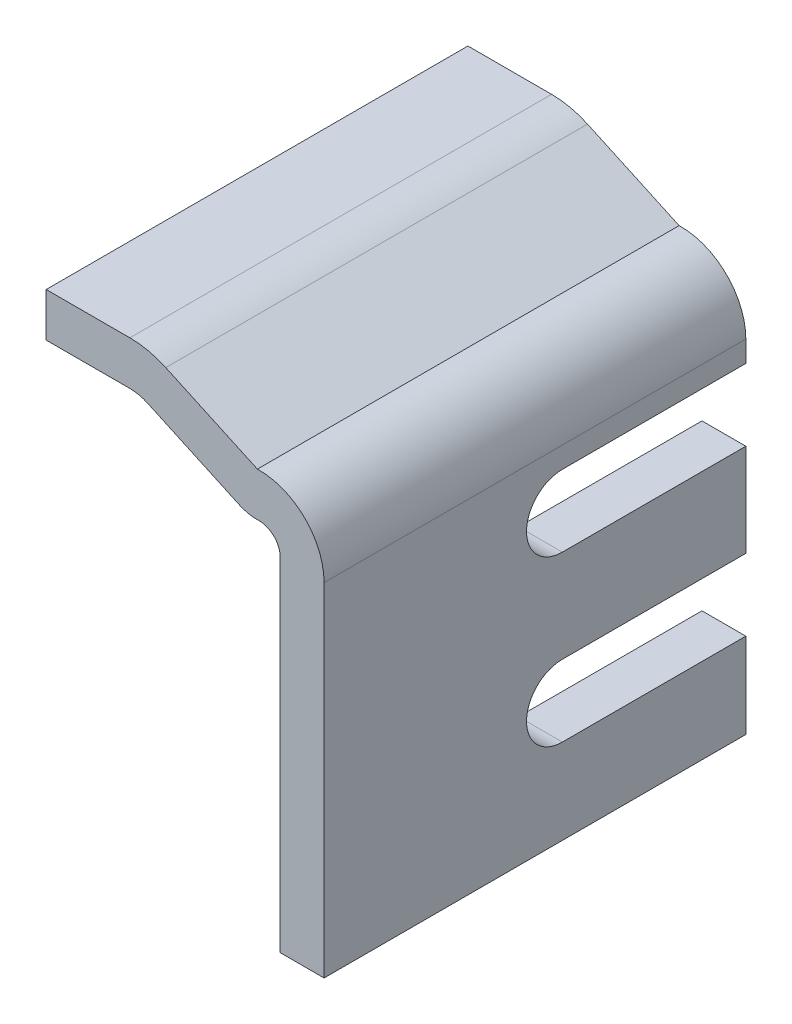
ISO-10303-21;
HEADER;
FILE_DESCRIPTION(('STEP AP214'),'2;1');
FILE_NAME('part.step','',(''),(''),'','','');
FILE_SCHEMA(('AUTOMOTIVE_DESIGN { 1 0 10303 214 1 1 1 1 }'));
ENDSEC;
DATA;
#1=APPLICATION_CONTEXT('core data for automotive mechanical design processes');
#2=APPLICATION_PROTOCOL_DEFINITION('international standard','automotive_design',2000,#1);
#3=PRODUCT_CONTEXT('',#1,'mechanical');
#4=PRODUCT('Part','Part','',(#3));
#5=PRODUCT_RELATED_PRODUCT_CATEGORY('part','',(#4));
#6=PRODUCT_DEFINITION_FORMATION('','',#4);
#7=PRODUCT_DEFINITION_CONTEXT('part definition',#1,'design');
#8=PRODUCT_DEFINITION('design','',#6,#7);
#9=PRODUCT_DEFINITION_SHAPE('','',#8);
#10=(LENGTH_UNIT() NAMED_UNIT(*) SI_UNIT(.MILLI.,.METRE.));
#11=(NAMED_UNIT(*) PLANE_ANGLE_UNIT() SI_UNIT($,.RADIAN.));
#12=(NAMED_UNIT(*) SI_UNIT($,.STERADIAN.) SOLID_ANGLE_UNIT());
#13=UNCERTAINTY_MEASURE_WITH_UNIT(LENGTH_MEASURE(1.E-05),#10,'distance_accuracy_value','');
#14=(GEOMETRIC_REPRESENTATION_CONTEXT(3) GLOBAL_UNCERTAINTY_ASSIGNED_CONTEXT((#13)) GLOBAL_UNIT_ASSIGNED_CONTEXT((#10,
#11,#12)) REPRESENTATION_CONTEXT('',''));
#15=CARTESIAN_POINT('',(0.,0.,0.));
#16=DIRECTION('',(0.,0.,1.));
#17=DIRECTION('',(1.,0.,0.));
#18=AXIS2_PLACEMENT_3D('',#15,#16,#17);
#19=CARTESIAN_POINT('',(-1.02145174439168,0.995862311877173,1.25));
#20=DIRECTION('',(0.,0.,1.));
#21=DIRECTION('',(1.,0.,0.));
#22=AXIS2_PLACEMENT_3D('',#19,#20,#21);
#23=CYLINDRICAL_SURFACE('',#22,0.25);
#24=DIRECTION('',(0.,0.,1.));
#25=VECTOR('',#24,1.);
#26=CARTESIAN_POINT('',(-0.917103913698396,1.22304402379432,1.25));
#27=LINE('',#26,#25);
#28=CARTESIAN_POINT('',(-0.917103913698397,1.22304402379432,-1.25));
#29=VERTEX_POINT('',#28);
#30=CARTESIAN_POINT('',(-0.917103913698397,1.22304402379432,1.25));
#31=VERTEX_POINT('',#30);
#32=EDGE_CURVE('E160',#29,#31,#27,.T.);
#33=ORIENTED_EDGE('',*,*,#32,.T.);
#34=CARTESIAN_POINT('',(-1.02145174439168,0.995862311877173,1.25));
#35=DIRECTION('',(0.,0.,1.));
#36=DIRECTION('',(1.,0.,0.));
#37=AXIS2_PLACEMENT_3D('',#34,#35,#36);
#38=CIRCLE('',#37,0.25);
#39=CARTESIAN_POINT('',(-1.02145174439168,1.24586231187717,1.25));
#40=VERTEX_POINT('',#39);
#41=EDGE_CURVE('E19',#40,#31,#38,.F.);
#42=ORIENTED_EDGE('',*,*,#41,.F.);
#43=DIRECTION('',(0.,0.,1.));
#44=VECTOR('',#43,1.);
#45=CARTESIAN_POINT('',(-1.02145174439168,1.24586231187717,1.25));
#46=LINE('',#45,#44);
#47=CARTESIAN_POINT('',(-1.02145174439168,1.24586231187717,-1.25));
#48=VERTEX_POINT('',#47);
#49=EDGE_CURVE('E158',#40,#48,#46,.F.);
#50=ORIENTED_EDGE('',*,*,#49,.T.);
#51=CARTESIAN_POINT('',(-1.02145174439168,0.995862311877173,-1.25));
#52=DIRECTION('',(0.,0.,1.));
#53=DIRECTION('',(1.,0.,0.));
#54=AXIS2_PLACEMENT_3D('',#51,#52,#53);
#55=CIRCLE('',#54,0.25);
#56=EDGE_CURVE('E165',#29,#48,#55,.T.);
#57=ORIENTED_EDGE('',*,*,#56,.F.);
#58=EDGE_LOOP('',(#33,#42,#50,#57));
#59=FACE_BOUND('',#58,.T.);
#60=ADVANCED_FACE('F16',(#59),#23,.F.);
#61=CARTESIAN_POINT('',(-1.02145174439168,1.24586231187717,1.25));
#62=DIRECTION('',(0.,1.,0.));
#63=DIRECTION('',(-1.,0.,0.));
#64=AXIS2_PLACEMENT_3D('',#61,#62,#63);
#65=PLANE('',#64);
#66=ORIENTED_EDGE('',*,*,#49,.F.);
#67=DIRECTION('',(-1.,0.,0.));
#68=VECTOR('',#67,1.);
#69=CARTESIAN_POINT('',(-1.02145174439168,1.24586231187717,1.25));
#70=LINE('',#69,#68);
#71=CARTESIAN_POINT('',(-1.5175,1.24586231187717,1.25));
#72=VERTEX_POINT('',#71);
#73=EDGE_CURVE('E170',#72,#40,#70,.F.);
#74=ORIENTED_EDGE('',*,*,#73,.F.);
#75=DIRECTION('',(0.,0.,-1.));
#76=VECTOR('',#75,1.);
#77=CARTESIAN_POINT('',(-1.5175,1.24586231187717,1.25));
#78=LINE('',#77,#76);
#79=CARTESIAN_POINT('',(-1.5175,1.24586231187717,-1.25));
#80=VERTEX_POINT('',#79);
#81=EDGE_CURVE('E236',#72,#80,#78,.T.);
#82=ORIENTED_EDGE('',*,*,#81,.T.);
#83=DIRECTION('',(-1.,0.,0.));
#84=VECTOR('',#83,1.);
#85=CARTESIAN_POINT('',(-1.02145174439168,1.24586231187717,-1.25));
#86=LINE('',#85,#84);
#87=EDGE_CURVE('E172',#48,#80,#86,.T.);
#88=ORIENTED_EDGE('',*,*,#87,.F.);
#89=EDGE_LOOP('',(#66,#74,#82,#88));
#90=FACE_BOUND('',#89,.T.);
#91=ADVANCED_FACE('F168',(#90),#65,.F.);
#92=CARTESIAN_POINT('',(-0.37186780509724,0.972609230130447,1.25));
#93=DIRECTION('',(0.417391322773125,0.908726847668595,0.));
#94=DIRECTION('',(-0.908726847668595,0.417391322773125,0.));
#95=AXIS2_PLACEMENT_3D('',#92,#93,#94);
#96=PLANE('',#95);
#97=DIRECTION('',(0.,0.,1.));
#98=VECTOR('',#97,1.);
#99=CARTESIAN_POINT('',(-0.371867805097238,0.972609230130451,1.25));
#100=LINE('',#99,#98);
#101=CARTESIAN_POINT('',(-0.37186780509724,0.972609230130449,1.25));
#102=VERTEX_POINT('',#101);
#103=CARTESIAN_POINT('',(-0.37186780509724,0.972609230130449,-1.25));
#104=VERTEX_POINT('',#103);
#105=EDGE_CURVE('E228',#102,#104,#100,.F.);
#106=ORIENTED_EDGE('',*,*,#105,.F.);
#107=DIRECTION('',(-0.908726847668595,0.417391322773125,0.));
#108=VECTOR('',#107,1.);
#109=CARTESIAN_POINT('',(-0.37186780509724,0.972609230130447,1.25));
#110=LINE('',#109,#108);
#111=EDGE_CURVE('E186',#31,#102,#110,.F.);
#112=ORIENTED_EDGE('',*,*,#111,.F.);
#113=ORIENTED_EDGE('',*,*,#32,.F.);
#114=DIRECTION('',(-0.908726847668595,0.417391322773125,0.));
#115=VECTOR('',#114,1.);
#116=CARTESIAN_POINT('',(-0.37186780509724,0.972609230130447,-1.25));
#117=LINE('',#116,#115);
#118=EDGE_CURVE('E250',#104,#29,#117,.T.);
#119=ORIENTED_EDGE('',*,*,#118,.F.);
#120=EDGE_LOOP('',(#106,#112,#113,#119));
#121=FACE_BOUND('',#120,.T.);
#122=ADVANCED_FACE('F452',(#121),#96,.F.);
#123=CARTESIAN_POINT('',(-1.5175,1.24586231187717,1.25));
#124=DIRECTION('',(1.,0.,0.));
#125=DIRECTION('',(0.,0.,-1.));
#126=AXIS2_PLACEMENT_3D('',#123,#124,#125);
#127=PLANE('',#126);
#128=ORIENTED_EDGE('',*,*,#81,.F.);
#129=DIRECTION('',(0.,1.,0.));
#130=VECTOR('',#129,1.);
#131=CARTESIAN_POINT('',(-1.5175,1.24586231187717,1.25));
#132=LINE('',#131,#130);
#133=CARTESIAN_POINT('',(-1.5175,1.50586231187718,1.25));
#134=VERTEX_POINT('',#133);
#135=EDGE_CURVE('E178',#134,#72,#132,.F.);
#136=ORIENTED_EDGE('',*,*,#135,.F.);
#137=DIRECTION('',(0.,0.,1.));
#138=VECTOR('',#137,1.);
#139=CARTESIAN_POINT('',(-1.5175,1.50586231187718,1.25));
#140=LINE('',#139,#138);
#141=CARTESIAN_POINT('',(-1.5175,1.50586231187718,-1.25));
#142=VERTEX_POINT('',#141);
#143=EDGE_CURVE('E265',#134,#142,#140,.F.);
#144=ORIENTED_EDGE('',*,*,#143,.T.);
#145=DIRECTION('',(0.,1.,0.));
#146=VECTOR('',#145,1.);
#147=CARTESIAN_POINT('',(-1.5175,1.24586231187717,-1.25));
#148=LINE('',#147,#146);
#149=EDGE_CURVE('E230',#80,#142,#148,.T.);
#150=ORIENTED_EDGE('',*,*,#149,.F.);
#151=EDGE_LOOP('',(#128,#136,#144,#150));
#152=FACE_BOUND('',#151,.T.);
#153=ADVANCED_FACE('F263',(#152),#127,.F.);
#154=CARTESIAN_POINT('',(-0.267519974403959,1.1997909420476,1.25));
#155=DIRECTION('',(0.,0.,1.));
#156=DIRECTION('',(1.,0.,0.));
#157=AXIS2_PLACEMENT_3D('',#154,#155,#156);
#158=CYLINDRICAL_SURFACE('',#157,0.25);
#159=CARTESIAN_POINT('',(-0.267519974403959,1.1997909420476,1.25));
#160=DIRECTION('',(0.,0.,1.));
#161=DIRECTION('',(1.,0.,0.));
#162=AXIS2_PLACEMENT_3D('',#159,#160,#161);
#163=CIRCLE('',#162,0.25);
#164=CARTESIAN_POINT('',(-0.259173324801319,0.949930314015867,1.25));
#165=VERTEX_POINT('',#164);
#166=EDGE_CURVE('E226',#165,#102,#163,.F.);
#167=ORIENTED_EDGE('',*,*,#166,.T.);
#168=ORIENTED_EDGE('',*,*,#105,.T.);
#169=CARTESIAN_POINT('',(-0.267519974403959,1.1997909420476,-1.25));
#170=DIRECTION('',(0.,0.,1.));
#171=DIRECTION('',(1.,0.,0.));
#172=AXIS2_PLACEMENT_3D('',#169,#170,#171);
#173=CIRCLE('',#172,0.25);
#174=CARTESIAN_POINT('',(-0.259173324801319,0.949930314015867,-1.25));
#175=VERTEX_POINT('',#174);
#176=EDGE_CURVE('E229',#104,#175,#173,.T.);
#177=ORIENTED_EDGE('',*,*,#176,.T.);
#178=DIRECTION('',(0.,0.,1.));
#179=VECTOR('',#178,1.);
#180=CARTESIAN_POINT('',(-0.259173324801318,0.949930314015865,1.25));
#181=LINE('',#180,#179);
#182=EDGE_CURVE('E225',#175,#165,#181,.T.);
#183=ORIENTED_EDGE('',*,*,#182,.T.);
#184=EDGE_LOOP('',(#167,#168,#177,#183));
#185=FACE_BOUND('',#184,.T.);
#186=ADVANCED_FACE('F449',(#185),#158,.T.);
#187=CARTESIAN_POINT('',(-1.02145174439168,1.50586231187718,1.25));
#188=DIRECTION('',(0.,-1.,0.));
#189=DIRECTION('',(1.,0.,0.));
#190=AXIS2_PLACEMENT_3D('',#187,#188,#189);
#191=PLANE('',#190);
#192=ORIENTED_EDGE('',*,*,#143,.F.);
#193=DIRECTION('',(1.,0.,0.));
#194=VECTOR('',#193,1.);
#195=CARTESIAN_POINT('',(-1.02145174439168,1.50586231187718,1.25));
#196=LINE('',#195,#194);
#197=CARTESIAN_POINT('',(-1.02145174439168,1.50586231187718,1.25));
#198=VERTEX_POINT('',#197);
#199=EDGE_CURVE('E255',#198,#134,#196,.F.);
#200=ORIENTED_EDGE('',*,*,#199,.F.);
#201=DIRECTION('',(0.,0.,1.));
#202=VECTOR('',#201,1.);
#203=CARTESIAN_POINT('',(-1.02145174439168,1.50586231187717,1.25));
#204=LINE('',#203,#202);
#205=CARTESIAN_POINT('',(-1.02145174439168,1.50586231187718,-1.25));
#206=VERTEX_POINT('',#205);
#207=EDGE_CURVE('E217',#206,#198,#204,.T.);
#208=ORIENTED_EDGE('',*,*,#207,.F.);
#209=DIRECTION('',(1.,0.,0.));
#210=VECTOR('',#209,1.);
#211=CARTESIAN_POINT('',(-1.02145174439168,1.50586231187718,-1.25));
#212=LINE('',#211,#210);
#213=EDGE_CURVE('E267',#142,#206,#212,.T.);
#214=ORIENTED_EDGE('',*,*,#213,.F.);
#215=EDGE_LOOP('',(#192,#200,#208,#214));
#216=FACE_BOUND('',#215,.T.);
#217=ADVANCED_FACE('F502',(#216),#191,.F.);
#218=CARTESIAN_POINT('',(-0.255,0.825,1.25));
#219=DIRECTION('',(0.,0.,1.));
#220=DIRECTION('',(1.,0.,0.));
#221=AXIS2_PLACEMENT_3D('',#218,#219,#220);
#222=CYLINDRICAL_SURFACE('',#221,0.125);
#223=DIRECTION('',(0.,0.,-1.));
#224=VECTOR('',#223,1.);
#225=CARTESIAN_POINT('',(-0.129999999999998,0.825,1.25));
#226=LINE('',#225,#224);
#227=CARTESIAN_POINT('',(-0.129999999999998,0.825,-1.25));
#228=VERTEX_POINT('',#227);
#229=CARTESIAN_POINT('',(-0.129999999999999,0.825,1.25));
#230=VERTEX_POINT('',#229);
#231=EDGE_CURVE('E288',#228,#230,#226,.F.);
#232=ORIENTED_EDGE('',*,*,#231,.T.);
#233=CARTESIAN_POINT('',(-0.255,0.825,1.25));
#234=DIRECTION('',(0.,0.,1.));
#235=DIRECTION('',(1.,0.,0.));
#236=AXIS2_PLACEMENT_3D('',#233,#234,#235);
#237=CIRCLE('',#236,0.125);
#238=EDGE_CURVE('E223',#165,#230,#237,.F.);
#239=ORIENTED_EDGE('',*,*,#238,.F.);
#240=ORIENTED_EDGE('',*,*,#182,.F.);
#241=CARTESIAN_POINT('',(-0.255,0.825,-1.25));
#242=DIRECTION('',(0.,0.,1.));
#243=DIRECTION('',(1.,0.,0.));
#244=AXIS2_PLACEMENT_3D('',#241,#242,#243);
#245=CIRCLE('',#244,0.125);
#246=EDGE_CURVE('E220',#228,#175,#245,.T.);
#247=ORIENTED_EDGE('',*,*,#246,.F.);
#248=EDGE_LOOP('',(#232,#239,#240,#247));
#249=FACE_BOUND('',#248,.T.);
#250=ADVANCED_FACE('F447',(#249),#222,.F.);
#251=CARTESIAN_POINT('',(-1.02145174439168,0.995862311877173,1.25));
#252=DIRECTION('',(0.,0.,1.));
#253=DIRECTION('',(1.,0.,0.));
#254=AXIS2_PLACEMENT_3D('',#251,#252,#253);
#255=CYLINDRICAL_SURFACE('',#254,0.51);
#256=CARTESIAN_POINT('',(-1.02145174439168,0.995862311877173,1.25));
#257=DIRECTION('',(0.,0.,1.));
#258=DIRECTION('',(1.,0.,0.));
#259=AXIS2_PLACEMENT_3D('',#256,#257,#258);
#260=CIRCLE('',#259,0.51);
#261=CARTESIAN_POINT('',(-0.808582169777383,1.45931300418815,1.25));
#262=VERTEX_POINT('',#261);
#263=EDGE_CURVE('E214',#198,#262,#260,.F.);
#264=ORIENTED_EDGE('',*,*,#263,.T.);
#265=DIRECTION('',(0.,0.,1.));
#266=VECTOR('',#265,1.);
#267=CARTESIAN_POINT('',(-0.808582169777388,1.45931300418815,1.25));
#268=LINE('',#267,#266);
#269=CARTESIAN_POINT('',(-0.808582169777388,1.45931300418815,-1.25));
#270=VERTEX_POINT('',#269);
#271=EDGE_CURVE('E306',#262,#270,#268,.F.);
#272=ORIENTED_EDGE('',*,*,#271,.T.);
#273=CARTESIAN_POINT('',(-1.02145174439168,0.995862311877173,-1.25));
#274=DIRECTION('',(0.,0.,1.));
#275=DIRECTION('',(1.,0.,0.));
#276=AXIS2_PLACEMENT_3D('',#273,#274,#275);
#277=CIRCLE('',#276,0.51);
#278=EDGE_CURVE('E218',#270,#206,#277,.T.);
#279=ORIENTED_EDGE('',*,*,#278,.T.);
#280=ORIENTED_EDGE('',*,*,#207,.T.);
#281=EDGE_LOOP('',(#264,#272,#279,#280));
#282=FACE_BOUND('',#281,.T.);
#283=ADVANCED_FACE('F496',(#282),#255,.T.);
#284=CARTESIAN_POINT('',(-0.129999999999998,-0.825,1.25));
#285=DIRECTION('',(1.,0.,0.));
#286=DIRECTION('',(0.,0.,-1.));
#287=AXIS2_PLACEMENT_3D('',#284,#285,#286);
#288=PLANE('',#287);
#289=DIRECTION('',(0.,1.,0.));
#290=VECTOR('',#289,1.);
#291=CARTESIAN_POINT('',(-0.13,0.825,-1.25));
#292=LINE('',#291,#290);
#293=CARTESIAN_POINT('',(-0.13,-1.205,-1.25));
#294=VERTEX_POINT('',#293);
#295=CARTESIAN_POINT('',(-0.129999999999999,-0.7,-1.25));
#296=VERTEX_POINT('',#295);
#297=EDGE_CURVE('E295',#294,#296,#292,.T.);
#298=ORIENTED_EDGE('',*,*,#297,.F.);
#299=DIRECTION('',(0.,0.,-1.));
#300=VECTOR('',#299,1.);
#301=CARTESIAN_POINT('',(-0.13,-1.205,1.25));
#302=LINE('',#301,#300);
#303=CARTESIAN_POINT('',(-0.13,-1.205,1.25));
#304=VERTEX_POINT('',#303);
#305=EDGE_CURVE('E298',#304,#294,#302,.T.);
#306=ORIENTED_EDGE('',*,*,#305,.F.);
#307=DIRECTION('',(0.,1.,0.));
#308=VECTOR('',#307,1.);
#309=CARTESIAN_POINT('',(-0.13,0.825,1.25));
#310=LINE('',#309,#308);
#311=EDGE_CURVE('E346',#304,#230,#310,.T.);
#312=ORIENTED_EDGE('',*,*,#311,.T.);
#313=ORIENTED_EDGE('',*,*,#231,.F.);
#314=DIRECTION('',(0.,1.,0.));
#315=VECTOR('',#314,1.);
#316=CARTESIAN_POINT('',(-0.129999999999998,-0.825,-1.25));
#317=LINE('',#316,#315);
#318=CARTESIAN_POINT('',(-0.129999999999998,0.7,-1.25));
#319=VERTEX_POINT('',#318);
#320=EDGE_CURVE('E285',#319,#228,#317,.T.);
#321=ORIENTED_EDGE('',*,*,#320,.F.);
#322=DIRECTION('',(0.,0.,-1.));
#323=VECTOR('',#322,1.);
#324=CARTESIAN_POINT('',(-0.129999999999998,0.7,1.25));
#325=LINE('',#324,#323);
#326=CARTESIAN_POINT('',(-0.129999999999998,0.7,-0.1625));
#327=VERTEX_POINT('',#326);
#328=EDGE_CURVE('E212',#327,#319,#325,.T.);
#329=ORIENTED_EDGE('',*,*,#328,.F.);
#330=CARTESIAN_POINT('',(-0.129999999999998,0.4875,-0.1625));
#331=DIRECTION('',(-1.,0.,0.));
#332=DIRECTION('',(0.,0.,1.));
#333=AXIS2_PLACEMENT_3D('',#330,#331,#332);
#334=CIRCLE('',#333,0.2125);
#335=CARTESIAN_POINT('',(-0.129999999999998,0.275,-0.1625));
#336=VERTEX_POINT('',#335);
#337=EDGE_CURVE('E209',#336,#327,#334,.T.);
#338=ORIENTED_EDGE('',*,*,#337,.F.);
#339=DIRECTION('',(0.,0.,-1.));
#340=VECTOR('',#339,1.);
#341=CARTESIAN_POINT('',(-0.129999999999998,0.275,1.25));
#342=LINE('',#341,#340);
#343=CARTESIAN_POINT('',(-0.129999999999998,0.275,-1.25));
#344=VERTEX_POINT('',#343);
#345=EDGE_CURVE('E213',#344,#336,#342,.F.);
#346=ORIENTED_EDGE('',*,*,#345,.F.);
#347=DIRECTION('',(0.,1.,0.));
#348=VECTOR('',#347,1.);
#349=CARTESIAN_POINT('',(-0.129999999999998,-0.825,-1.25));
#350=LINE('',#349,#348);
#351=CARTESIAN_POINT('',(-0.129999999999998,-0.275,-1.25));
#352=VERTEX_POINT('',#351);
#353=EDGE_CURVE('E280',#352,#344,#350,.T.);
#354=ORIENTED_EDGE('',*,*,#353,.F.);
#355=DIRECTION('',(0.,0.,-1.));
#356=VECTOR('',#355,1.);
#357=CARTESIAN_POINT('',(-0.129999999999998,-0.275,1.25));
#358=LINE('',#357,#356);
#359=CARTESIAN_POINT('',(-0.129999999999998,-0.275,-0.1625));
#360=VERTEX_POINT('',#359);
#361=EDGE_CURVE('E216',#360,#352,#358,.T.);
#362=ORIENTED_EDGE('',*,*,#361,.F.);
#363=CARTESIAN_POINT('',(-0.129999999999998,-0.4875,-0.1625));
#364=DIRECTION('',(-1.,0.,0.));
#365=DIRECTION('',(0.,0.,1.));
#366=AXIS2_PLACEMENT_3D('',#363,#364,#365);
#367=CIRCLE('',#366,0.2125);
#368=CARTESIAN_POINT('',(-0.129999999999998,-0.7,-0.1625));
#369=VERTEX_POINT('',#368);
#370=EDGE_CURVE('E204',#360,#369,#367,.F.);
#371=ORIENTED_EDGE('',*,*,#370,.T.);
#372=DIRECTION('',(0.,0.,1.));
#373=VECTOR('',#372,1.);
#374=CARTESIAN_POINT('',(-0.129999999999998,-0.7,-1.25));
#375=LINE('',#374,#373);
#376=EDGE_CURVE('E207',#296,#369,#375,.T.);
#377=ORIENTED_EDGE('',*,*,#376,.F.);
#378=EDGE_LOOP('',(#298,#306,#312,#313,#321,#329,#338,#346,#354,#362,#371,#377));
#379=FACE_BOUND('',#378,.T.);
#380=ADVANCED_FACE('F444',(#379),#288,.F.);
#381=CARTESIAN_POINT('',(-0.265477898106363,1.20985739391529,1.25));
#382=DIRECTION('',(-0.417391322773125,-0.908726847668594,0.));
#383=DIRECTION('',(0.908726847668594,-0.417391322773125,0.));
#384=AXIS2_PLACEMENT_3D('',#381,#382,#383);
#385=PLANE('',#384);
#386=ORIENTED_EDGE('',*,*,#271,.F.);
#387=DIRECTION('',(0.908726847668589,-0.417391322773138,0.));
#388=VECTOR('',#387,1.);
#389=CARTESIAN_POINT('',(-0.808582169777384,1.45931300418816,1.25));
#390=LINE('',#389,#388);
#391=CARTESIAN_POINT('',(-0.265477898106369,1.2098573939153,1.25));
#392=VERTEX_POINT('',#391);
#393=EDGE_CURVE('E322',#262,#392,#390,.T.);
#394=ORIENTED_EDGE('',*,*,#393,.T.);
#395=DIRECTION('',(0.,0.,1.));
#396=VECTOR('',#395,1.);
#397=CARTESIAN_POINT('',(-0.265477898106363,1.2098573939153,1.25));
#398=LINE('',#397,#396);
#399=CARTESIAN_POINT('',(-0.265477898106369,1.2098573939153,-1.25));
#400=VERTEX_POINT('',#399);
#401=EDGE_CURVE('E203',#400,#392,#398,.T.);
#402=ORIENTED_EDGE('',*,*,#401,.F.);
#403=DIRECTION('',(0.908726847668594,-0.417391322773125,0.));
#404=VECTOR('',#403,1.);
#405=CARTESIAN_POINT('',(-0.265477898106363,1.20985739391529,-1.25));
#406=LINE('',#405,#404);
#407=EDGE_CURVE('E208',#270,#400,#406,.T.);
#408=ORIENTED_EDGE('',*,*,#407,.F.);
#409=EDGE_LOOP('',(#386,#394,#402,#408));
#410=FACE_BOUND('',#409,.T.);
#411=ADVANCED_FACE('F490',(#410),#385,.F.);
#412=CARTESIAN_POINT('',(3.79436099586339,-0.4875,-0.1625));
#413=DIRECTION('',(-1.,0.,0.));
#414=DIRECTION('',(0.,0.,1.));
#415=AXIS2_PLACEMENT_3D('',#412,#413,#414);
#416=CYLINDRICAL_SURFACE('',#415,0.2125);
#417=DIRECTION('',(1.,0.,0.));
#418=VECTOR('',#417,1.);
#419=CARTESIAN_POINT('',(3.79436099586339,-0.7,-0.1625));
#420=LINE('',#419,#418);
#421=CARTESIAN_POINT('',(0.130000000000002,-0.7,-0.1625));
#422=VERTEX_POINT('',#421);
#423=EDGE_CURVE('E292',#369,#422,#420,.T.);
#424=ORIENTED_EDGE('',*,*,#423,.F.);
#425=ORIENTED_EDGE('',*,*,#370,.F.);
#426=DIRECTION('',(1.,0.,0.));
#427=VECTOR('',#426,1.);
#428=CARTESIAN_POINT('',(3.79436099586339,-0.275,-0.1625));
#429=LINE('',#428,#427);
#430=CARTESIAN_POINT('',(0.130000000000002,-0.275,-0.1625));
#431=VERTEX_POINT('',#430);
#432=EDGE_CURVE('E197',#431,#360,#429,.F.);
#433=ORIENTED_EDGE('',*,*,#432,.F.);
#434=CARTESIAN_POINT('',(0.130000000000002,-0.4875,-0.1625));
#435=DIRECTION('',(-1.,0.,0.));
#436=DIRECTION('',(0.,0.,1.));
#437=AXIS2_PLACEMENT_3D('',#434,#435,#436);
#438=CIRCLE('',#437,0.2125);
#439=EDGE_CURVE('E193',#431,#422,#438,.F.);
#440=ORIENTED_EDGE('',*,*,#439,.T.);
#441=EDGE_LOOP('',(#424,#425,#433,#440));
#442=FACE_BOUND('',#441,.T.);
#443=ADVANCED_FACE('F438',(#442),#416,.F.);
#444=CARTESIAN_POINT('',(3.79436099586339,-0.7,-1.25));
#445=DIRECTION('',(0.,1.,0.));
#446=DIRECTION('',(0.,0.,1.));
#447=AXIS2_PLACEMENT_3D('',#444,#445,#446);
#448=PLANE('',#447);
#449=ORIENTED_EDGE('',*,*,#376,.T.);
#450=ORIENTED_EDGE('',*,*,#423,.T.);
#451=DIRECTION('',(0.,0.,1.));
#452=VECTOR('',#451,1.);
#453=CARTESIAN_POINT('',(0.130000000000002,-0.7,1.25));
#454=LINE('',#453,#452);
#455=CARTESIAN_POINT('',(0.130000000000002,-0.7,-1.25));
#456=VERTEX_POINT('',#455);
#457=EDGE_CURVE('E196',#422,#456,#454,.F.);
#458=ORIENTED_EDGE('',*,*,#457,.T.);
#459=DIRECTION('',(-1.,0.,0.));
#460=VECTOR('',#459,1.);
#461=CARTESIAN_POINT('',(-0.255,-0.7,-1.25));
#462=LINE('',#461,#460);
#463=EDGE_CURVE('E299',#296,#456,#462,.F.);
#464=ORIENTED_EDGE('',*,*,#463,.F.);
#465=EDGE_LOOP('',(#449,#450,#458,#464));
#466=FACE_BOUND('',#465,.T.);
#467=ADVANCED_FACE('F434',(#466),#448,.T.);
#468=CARTESIAN_POINT('',(-0.255,0.825,-1.25));
#469=DIRECTION('',(0.,0.,-1.));
#470=DIRECTION('',(-1.,0.,0.));
#471=AXIS2_PLACEMENT_3D('',#468,#469,#470);
#472=PLANE('',#471);
#473=DIRECTION('',(1.,0.,0.));
#474=VECTOR('',#473,1.);
#475=CARTESIAN_POINT('',(0.130000000000002,-1.205,-1.25));
#476=LINE('',#475,#474);
#477=CARTESIAN_POINT('',(0.130000000000002,-1.205,-1.25));
#478=VERTEX_POINT('',#477);
#479=EDGE_CURVE('E303',#294,#478,#476,.T.);
#480=ORIENTED_EDGE('',*,*,#479,.F.);
#481=ORIENTED_EDGE('',*,*,#297,.T.);
#482=ORIENTED_EDGE('',*,*,#463,.T.);
#483=DIRECTION('',(0.,1.,0.));
#484=VECTOR('',#483,1.);
#485=CARTESIAN_POINT('',(0.130000000000002,-0.825,-1.25));
#486=LINE('',#485,#484);
#487=EDGE_CURVE('E329',#456,#478,#486,.F.);
#488=ORIENTED_EDGE('',*,*,#487,.T.);
#489=EDGE_LOOP('',(#480,#481,#482,#488));
#490=FACE_BOUND('',#489,.T.);
#491=ADVANCED_FACE('F431',(#490),#472,.T.);
#492=CARTESIAN_POINT('',(0.130000000000002,-1.205,1.25));
#493=DIRECTION('',(0.,-1.,0.));
#494=DIRECTION('',(0.,0.,-1.));
#495=AXIS2_PLACEMENT_3D('',#492,#493,#494);
#496=PLANE('',#495);
#497=ORIENTED_EDGE('',*,*,#479,.T.);
#498=DIRECTION('',(0.,0.,1.));
#499=VECTOR('',#498,1.);
#500=CARTESIAN_POINT('',(0.130000000000002,-1.205,1.25));
#501=LINE('',#500,#499);
#502=CARTESIAN_POINT('',(0.130000000000002,-1.205,1.25));
#503=VERTEX_POINT('',#502);
#504=EDGE_CURVE('E332',#478,#503,#501,.T.);
#505=ORIENTED_EDGE('',*,*,#504,.T.);
#506=DIRECTION('',(-1.,0.,0.));
#507=VECTOR('',#506,1.);
#508=CARTESIAN_POINT('',(-0.255,-1.205,1.25));
#509=LINE('',#508,#507);
#510=EDGE_CURVE('E336',#503,#304,#509,.T.);
#511=ORIENTED_EDGE('',*,*,#510,.T.);
#512=ORIENTED_EDGE('',*,*,#305,.T.);
#513=EDGE_LOOP('',(#497,#505,#511,#512));
#514=FACE_BOUND('',#513,.T.);
#515=ADVANCED_FACE('F425',(#514),#496,.T.);
#516=CARTESIAN_POINT('',(-0.255,0.825,1.25));
#517=DIRECTION('',(0.,0.,-1.));
#518=DIRECTION('',(-1.,0.,0.));
#519=AXIS2_PLACEMENT_3D('',#516,#517,#518);
#520=PLANE('',#519);
#521=CARTESIAN_POINT('',(-0.255,0.825,1.25));
#522=DIRECTION('',(0.,0.,1.));
#523=DIRECTION('',(1.,0.,0.));
#524=AXIS2_PLACEMENT_3D('',#521,#522,#523);
#525=CIRCLE('',#524,0.385);
#526=CARTESIAN_POINT('',(0.130000000000002,0.825,1.25));
#527=VERTEX_POINT('',#526);
#528=EDGE_CURVE('E201',#392,#527,#525,.F.);
#529=ORIENTED_EDGE('',*,*,#528,.F.);
#530=ORIENTED_EDGE('',*,*,#393,.F.);
#531=ORIENTED_EDGE('',*,*,#263,.F.);
#532=ORIENTED_EDGE('',*,*,#199,.T.);
#533=ORIENTED_EDGE('',*,*,#135,.T.);
#534=ORIENTED_EDGE('',*,*,#73,.T.);
#535=ORIENTED_EDGE('',*,*,#41,.T.);
#536=ORIENTED_EDGE('',*,*,#111,.T.);
#537=ORIENTED_EDGE('',*,*,#166,.F.);
#538=ORIENTED_EDGE('',*,*,#238,.T.);
#539=ORIENTED_EDGE('',*,*,#311,.F.);
#540=ORIENTED_EDGE('',*,*,#510,.F.);
#541=DIRECTION('',(0.,1.,0.));
#542=VECTOR('',#541,1.);
#543=CARTESIAN_POINT('',(0.130000000000002,-0.825,1.25));
#544=LINE('',#543,#542);
#545=EDGE_CURVE('E341',#503,#527,#544,.T.);
#546=ORIENTED_EDGE('',*,*,#545,.T.);
#547=EDGE_LOOP('',(#529,#530,#531,#532,#533,#534,#535,#536,#537,#538,#539,#540,#546));
#548=FACE_BOUND('',#547,.T.);
#549=ADVANCED_FACE('F176',(#548),#520,.F.);
#550=CARTESIAN_POINT('',(-0.255,0.825,1.25));
#551=DIRECTION('',(0.,0.,1.));
#552=DIRECTION('',(1.,0.,0.));
#553=AXIS2_PLACEMENT_3D('',#550,#551,#552);
#554=CYLINDRICAL_SURFACE('',#553,0.385);
#555=ORIENTED_EDGE('',*,*,#528,.T.);
#556=DIRECTION('',(0.,0.,1.));
#557=VECTOR('',#556,1.);
#558=CARTESIAN_POINT('',(0.130000000000002,0.825,1.25));
#559=LINE('',#558,#557);
#560=CARTESIAN_POINT('',(0.130000000000002,0.825,-1.25));
#561=VERTEX_POINT('',#560);
#562=EDGE_CURVE('E357',#527,#561,#559,.F.);
#563=ORIENTED_EDGE('',*,*,#562,.T.);
#564=CARTESIAN_POINT('',(-0.255,0.825,-1.25));
#565=DIRECTION('',(0.,0.,1.));
#566=DIRECTION('',(1.,0.,0.));
#567=AXIS2_PLACEMENT_3D('',#564,#565,#566);
#568=CIRCLE('',#567,0.385);
#569=EDGE_CURVE('E198',#400,#561,#568,.F.);
#570=ORIENTED_EDGE('',*,*,#569,.F.);
#571=ORIENTED_EDGE('',*,*,#401,.T.);
#572=EDGE_LOOP('',(#555,#563,#570,#571));
#573=FACE_BOUND('',#572,.T.);
#574=ADVANCED_FACE('F419',(#573),#554,.T.);
#575=CARTESIAN_POINT('',(-0.255,0.825,-1.25));
#576=DIRECTION('',(0.,0.,-1.));
#577=DIRECTION('',(-1.,0.,0.));
#578=AXIS2_PLACEMENT_3D('',#575,#576,#577);
#579=PLANE('',#578);
#580=DIRECTION('',(0.,1.,0.));
#581=VECTOR('',#580,1.);
#582=CARTESIAN_POINT('',(0.130000000000002,-0.825,-1.25));
#583=LINE('',#582,#581);
#584=CARTESIAN_POINT('',(0.130000000000002,0.7,-1.25));
#585=VERTEX_POINT('',#584);
#586=EDGE_CURVE('E360',#561,#585,#583,.F.);
#587=ORIENTED_EDGE('',*,*,#586,.T.);
#588=DIRECTION('',(1.,0.,0.));
#589=VECTOR('',#588,1.);
#590=CARTESIAN_POINT('',(3.79436099586339,0.7,-1.25));
#591=LINE('',#590,#589);
#592=EDGE_CURVE('E200',#585,#319,#591,.F.);
#593=ORIENTED_EDGE('',*,*,#592,.T.);
#594=ORIENTED_EDGE('',*,*,#320,.T.);
#595=ORIENTED_EDGE('',*,*,#246,.T.);
#596=ORIENTED_EDGE('',*,*,#176,.F.);
#597=ORIENTED_EDGE('',*,*,#118,.T.);
#598=ORIENTED_EDGE('',*,*,#56,.T.);
#599=ORIENTED_EDGE('',*,*,#87,.T.);
#600=ORIENTED_EDGE('',*,*,#149,.T.);
#601=ORIENTED_EDGE('',*,*,#213,.T.);
#602=ORIENTED_EDGE('',*,*,#278,.F.);
#603=ORIENTED_EDGE('',*,*,#407,.T.);
#604=ORIENTED_EDGE('',*,*,#569,.T.);
#605=EDGE_LOOP('',(#587,#593,#594,#595,#596,#597,#598,#599,#600,#601,#602,#603,#604));
#606=FACE_BOUND('',#605,.T.);
#607=ADVANCED_FACE('F260',(#606),#579,.T.);
#608=CARTESIAN_POINT('',(3.79436099586339,0.7,-1.25));
#609=DIRECTION('',(0.,1.,0.));
#610=DIRECTION('',(0.,0.,1.));
#611=AXIS2_PLACEMENT_3D('',#608,#609,#610);
#612=PLANE('',#611);
#613=ORIENTED_EDGE('',*,*,#592,.F.);
#614=DIRECTION('',(0.,0.,1.));
#615=VECTOR('',#614,1.);
#616=CARTESIAN_POINT('',(0.130000000000002,0.7,1.25));
#617=LINE('',#616,#615);
#618=CARTESIAN_POINT('',(0.130000000000002,0.7,-0.1625));
#619=VERTEX_POINT('',#618);
#620=EDGE_CURVE('E192',#585,#619,#617,.T.);
#621=ORIENTED_EDGE('',*,*,#620,.T.);
#622=DIRECTION('',(-1.,0.,0.));
#623=VECTOR('',#622,1.);
#624=CARTESIAN_POINT('',(3.79436099586339,0.7,-0.1625));
#625=LINE('',#624,#623);
#626=EDGE_CURVE('E368',#619,#327,#625,.T.);
#627=ORIENTED_EDGE('',*,*,#626,.T.);
#628=ORIENTED_EDGE('',*,*,#328,.T.);
#629=EDGE_LOOP('',(#613,#621,#627,#628));
#630=FACE_BOUND('',#629,.T.);
#631=ADVANCED_FACE('F412',(#630),#612,.F.);
#632=CARTESIAN_POINT('',(3.79436099586339,0.4875,-0.1625));
#633=DIRECTION('',(-1.,0.,0.));
#634=DIRECTION('',(0.,0.,1.));
#635=AXIS2_PLACEMENT_3D('',#632,#633,#634);
#636=CYLINDRICAL_SURFACE('',#635,0.2125);
#637=DIRECTION('',(1.,0.,0.));
#638=VECTOR('',#637,1.);
#639=CARTESIAN_POINT('',(3.79436099586339,0.275,-0.1625));
#640=LINE('',#639,#638);
#641=CARTESIAN_POINT('',(0.130000000000002,0.275,-0.1625));
#642=VERTEX_POINT('',#641);
#643=EDGE_CURVE('E371',#642,#336,#640,.F.);
#644=ORIENTED_EDGE('',*,*,#643,.T.);
#645=ORIENTED_EDGE('',*,*,#337,.T.);
#646=ORIENTED_EDGE('',*,*,#626,.F.);
#647=CARTESIAN_POINT('',(0.130000000000002,0.4875,-0.1625));
#648=DIRECTION('',(-1.,0.,0.));
#649=DIRECTION('',(0.,0.,1.));
#650=AXIS2_PLACEMENT_3D('',#647,#648,#649);
#651=CIRCLE('',#650,0.2125);
#652=EDGE_CURVE('E188',#619,#642,#651,.F.);
#653=ORIENTED_EDGE('',*,*,#652,.T.);
#654=EDGE_LOOP('',(#644,#645,#646,#653));
#655=FACE_BOUND('',#654,.T.);
#656=ADVANCED_FACE('F410',(#655),#636,.F.);
#657=CARTESIAN_POINT('',(3.79436099586339,0.275,0.05));
#658=DIRECTION('',(0.,-1.,0.));
#659=DIRECTION('',(0.,0.,-1.));
#660=AXIS2_PLACEMENT_3D('',#657,#658,#659);
#661=PLANE('',#660);
#662=DIRECTION('',(-1.,0.,0.));
#663=VECTOR('',#662,1.);
#664=CARTESIAN_POINT('',(-0.255,0.275,-1.25));
#665=LINE('',#664,#663);
#666=CARTESIAN_POINT('',(0.130000000000002,0.275,-1.25));
#667=VERTEX_POINT('',#666);
#668=EDGE_CURVE('E374',#344,#667,#665,.F.);
#669=ORIENTED_EDGE('',*,*,#668,.F.);
#670=ORIENTED_EDGE('',*,*,#345,.T.);
#671=ORIENTED_EDGE('',*,*,#643,.F.);
#672=DIRECTION('',(0.,0.,1.));
#673=VECTOR('',#672,1.);
#674=CARTESIAN_POINT('',(0.130000000000002,0.275,1.25));
#675=LINE('',#674,#673);
#676=EDGE_CURVE('E191',#642,#667,#675,.F.);
#677=ORIENTED_EDGE('',*,*,#676,.T.);
#678=EDGE_LOOP('',(#669,#670,#671,#677));
#679=FACE_BOUND('',#678,.T.);
#680=ADVANCED_FACE('F403',(#679),#661,.F.);
#681=CARTESIAN_POINT('',(-0.255,0.825,-1.25));
#682=DIRECTION('',(0.,0.,-1.));
#683=DIRECTION('',(-1.,0.,0.));
#684=AXIS2_PLACEMENT_3D('',#681,#682,#683);
#685=PLANE('',#684);
#686=DIRECTION('',(0.,1.,0.));
#687=VECTOR('',#686,1.);
#688=CARTESIAN_POINT('',(0.130000000000002,-0.825,-1.25));
#689=LINE('',#688,#687);
#690=CARTESIAN_POINT('',(0.130000000000002,-0.275,-1.25));
#691=VERTEX_POINT('',#690);
#692=EDGE_CURVE('E25',#667,#691,#689,.F.);
#693=ORIENTED_EDGE('',*,*,#692,.T.);
#694=DIRECTION('',(1.,0.,0.));
#695=VECTOR('',#694,1.);
#696=CARTESIAN_POINT('',(3.79436099586339,-0.275,-1.25));
#697=LINE('',#696,#695);
#698=EDGE_CURVE('E33',#352,#691,#697,.T.);
#699=ORIENTED_EDGE('',*,*,#698,.F.);
#700=ORIENTED_EDGE('',*,*,#353,.T.);
#701=ORIENTED_EDGE('',*,*,#668,.T.);
#702=EDGE_LOOP('',(#693,#699,#700,#701));
#703=FACE_BOUND('',#702,.T.);
#704=ADVANCED_FACE('F442',(#703),#685,.T.);
#705=CARTESIAN_POINT('',(3.79436099586339,-0.275,0.05));
#706=DIRECTION('',(0.,-1.,0.));
#707=DIRECTION('',(0.,0.,-1.));
#708=AXIS2_PLACEMENT_3D('',#705,#706,#707);
#709=PLANE('',#708);
#710=DIRECTION('',(0.,0.,1.));
#711=VECTOR('',#710,1.);
#712=CARTESIAN_POINT('',(0.130000000000002,-0.275,1.25));
#713=LINE('',#712,#711);
#714=EDGE_CURVE('E11',#691,#431,#713,.T.);
#715=ORIENTED_EDGE('',*,*,#714,.T.);
#716=ORIENTED_EDGE('',*,*,#432,.T.);
#717=ORIENTED_EDGE('',*,*,#361,.T.);
#718=ORIENTED_EDGE('',*,*,#698,.T.);
#719=EDGE_LOOP('',(#715,#716,#717,#718));
#720=FACE_BOUND('',#719,.T.);
#721=ADVANCED_FACE('F440',(#720),#709,.T.);
#722=CARTESIAN_POINT('',(0.130000000000002,-0.825,1.25));
#723=DIRECTION('',(-1.,0.,0.));
#724=DIRECTION('',(0.,0.,1.));
#725=AXIS2_PLACEMENT_3D('',#722,#723,#724);
#726=PLANE('',#725);
#727=ORIENTED_EDGE('',*,*,#692,.F.);
#728=ORIENTED_EDGE('',*,*,#676,.F.);
#729=ORIENTED_EDGE('',*,*,#652,.F.);
#730=ORIENTED_EDGE('',*,*,#620,.F.);
#731=ORIENTED_EDGE('',*,*,#586,.F.);
#732=ORIENTED_EDGE('',*,*,#562,.F.);
#733=ORIENTED_EDGE('',*,*,#545,.F.);
#734=ORIENTED_EDGE('',*,*,#504,.F.);
#735=ORIENTED_EDGE('',*,*,#487,.F.);
#736=ORIENTED_EDGE('',*,*,#457,.F.);
#737=ORIENTED_EDGE('',*,*,#439,.F.);
#738=ORIENTED_EDGE('',*,*,#714,.F.);
#739=EDGE_LOOP('',(#727,#728,#729,#730,#731,#732,#733,#734,#735,#736,#737,#738));
#740=FACE_BOUND('',#739,.T.);
#741=ADVANCED_FACE('F407',(#740),#726,.F.);
#742=CLOSED_SHELL('',(#60,#91,#122,#153,#186,#217,#250,#283,#380,#411,#443,#467,#491,#515,#549,
#574,#607,#631,#656,#680,#704,#721,#741));
#743=MANIFOLD_SOLID_BREP('B1',#742);
#744=ADVANCED_BREP_SHAPE_REPRESENTATION('',(#18,#743),#14);
#745=SHAPE_DEFINITION_REPRESENTATION(#9,#744);
ENDSEC;
END-ISO-10303-21;
